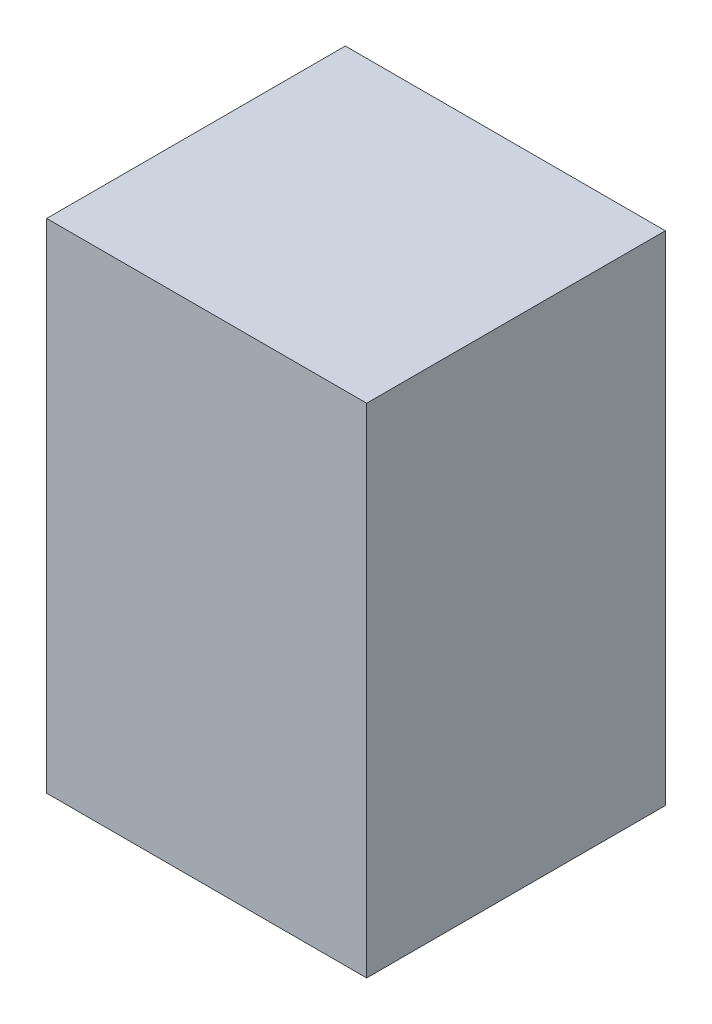
ISO-10303-21;
HEADER;
FILE_DESCRIPTION(('STEP AP214'),'2;1');
FILE_NAME('part.step','',(''),(''),'','','');
FILE_SCHEMA(('AUTOMOTIVE_DESIGN { 1 0 10303 214 1 1 1 1 }'));
ENDSEC;
DATA;
#1=APPLICATION_CONTEXT('core data for automotive mechanical design processes');
#2=APPLICATION_PROTOCOL_DEFINITION('international standard','automotive_design',2000,#1);
#3=PRODUCT_CONTEXT('',#1,'mechanical');
#4=PRODUCT('Part','Part','',(#3));
#5=PRODUCT_RELATED_PRODUCT_CATEGORY('part','',(#4));
#6=PRODUCT_DEFINITION_FORMATION('','',#4);
#7=PRODUCT_DEFINITION_CONTEXT('part definition',#1,'design');
#8=PRODUCT_DEFINITION('design','',#6,#7);
#9=PRODUCT_DEFINITION_SHAPE('','',#8);
#10=(LENGTH_UNIT() NAMED_UNIT(*) SI_UNIT(.MILLI.,.METRE.));
#11=(NAMED_UNIT(*) PLANE_ANGLE_UNIT() SI_UNIT($,.RADIAN.));
#12=(NAMED_UNIT(*) SI_UNIT($,.STERADIAN.) SOLID_ANGLE_UNIT());
#13=UNCERTAINTY_MEASURE_WITH_UNIT(LENGTH_MEASURE(1.E-05),#10,'distance_accuracy_value','');
#14=(GEOMETRIC_REPRESENTATION_CONTEXT(3) GLOBAL_UNCERTAINTY_ASSIGNED_CONTEXT((#13)) GLOBAL_UNIT_ASSIGNED_CONTEXT((#10,
#11,#12)) REPRESENTATION_CONTEXT('',''));
#15=CARTESIAN_POINT('',(0.,0.,0.));
#16=DIRECTION('',(0.,0.,1.));
#17=DIRECTION('',(1.,0.,0.));
#18=AXIS2_PLACEMENT_3D('',#15,#16,#17);
#19=CARTESIAN_POINT('',(-0.67499992,1.05000044,1.26));
#20=DIRECTION('',(0.,0.,1.));
#21=DIRECTION('',(1.,0.,0.));
#22=AXIS2_PLACEMENT_3D('',#19,#20,#21);
#23=PLANE('',#22);
#24=DIRECTION('',(0.,1.,0.));
#25=VECTOR('',#24,1.);
#26=CARTESIAN_POINT('',(0.67499992,1.05000044,1.26));
#27=LINE('',#26,#25);
#28=CARTESIAN_POINT('',(0.67499992,1.05000044,1.26));
#29=VERTEX_POINT('',#28);
#30=CARTESIAN_POINT('',(0.67499992,-1.05000044,1.26));
#31=VERTEX_POINT('',#30);
#32=EDGE_CURVE('E53',#29,#31,#27,.F.);
#33=ORIENTED_EDGE('',*,*,#32,.F.);
#34=DIRECTION('',(1.,0.,0.));
#35=VECTOR('',#34,1.);
#36=CARTESIAN_POINT('',(-0.67499992,1.05000044,1.26));
#37=LINE('',#36,#35);
#38=CARTESIAN_POINT('',(-0.67499992,1.05000044,1.26));
#39=VERTEX_POINT('',#38);
#40=EDGE_CURVE('E20',#29,#39,#37,.F.);
#41=ORIENTED_EDGE('',*,*,#40,.T.);
#42=DIRECTION('',(0.,1.,0.));
#43=VECTOR('',#42,1.);
#44=CARTESIAN_POINT('',(-0.67499992,-1.05000044,1.26));
#45=LINE('',#44,#43);
#46=CARTESIAN_POINT('',(-0.67499992,-1.05000044,1.26));
#47=VERTEX_POINT('',#46);
#48=EDGE_CURVE('E67',#47,#39,#45,.T.);
#49=ORIENTED_EDGE('',*,*,#48,.F.);
#50=DIRECTION('',(1.,0.,0.));
#51=VECTOR('',#50,1.);
#52=CARTESIAN_POINT('',(0.67499992,-1.05000044,1.26));
#53=LINE('',#52,#51);
#54=EDGE_CURVE('E58',#31,#47,#53,.F.);
#55=ORIENTED_EDGE('',*,*,#54,.F.);
#56=EDGE_LOOP('',(#33,#41,#49,#55));
#57=FACE_BOUND('',#56,.T.);
#58=ADVANCED_FACE('F17',(#57),#23,.T.);
#59=CARTESIAN_POINT('',(-0.67499992,-1.05000044,0.));
#60=DIRECTION('',(-1.,0.,0.));
#61=DIRECTION('',(0.,0.,1.));
#62=AXIS2_PLACEMENT_3D('',#59,#60,#61);
#63=PLANE('',#62);
#64=DIRECTION('',(0.,0.,1.));
#65=VECTOR('',#64,1.);
#66=CARTESIAN_POINT('',(-0.67499992,1.05000044,0.));
#67=LINE('',#66,#65);
#68=CARTESIAN_POINT('',(-0.67499992,1.05000044,0.));
#69=VERTEX_POINT('',#68);
#70=EDGE_CURVE('E80',#69,#39,#67,.T.);
#71=ORIENTED_EDGE('',*,*,#70,.F.);
#72=DIRECTION('',(0.,1.,0.));
#73=VECTOR('',#72,1.);
#74=CARTESIAN_POINT('',(-0.67499992,1.05000044,0.));
#75=LINE('',#74,#73);
#76=CARTESIAN_POINT('',(-0.67499992,-1.05000044,0.));
#77=VERTEX_POINT('',#76);
#78=EDGE_CURVE('E75',#69,#77,#75,.F.);
#79=ORIENTED_EDGE('',*,*,#78,.T.);
#80=DIRECTION('',(0.,0.,-1.));
#81=VECTOR('',#80,1.);
#82=CARTESIAN_POINT('',(-0.67499992,-1.05000044,0.));
#83=LINE('',#82,#81);
#84=EDGE_CURVE('E63',#47,#77,#83,.T.);
#85=ORIENTED_EDGE('',*,*,#84,.F.);
#86=ORIENTED_EDGE('',*,*,#48,.T.);
#87=EDGE_LOOP('',(#71,#79,#85,#86));
#88=FACE_BOUND('',#87,.T.);
#89=ADVANCED_FACE('F74',(#88),#63,.T.);
#90=CARTESIAN_POINT('',(0.67499992,-1.05000044,0.));
#91=DIRECTION('',(0.,-1.,0.));
#92=DIRECTION('',(0.,0.,-1.));
#93=AXIS2_PLACEMENT_3D('',#90,#91,#92);
#94=PLANE('',#93);
#95=ORIENTED_EDGE('',*,*,#84,.T.);
#96=DIRECTION('',(1.,0.,0.));
#97=VECTOR('',#96,1.);
#98=CARTESIAN_POINT('',(-0.67499992,-1.05000044,0.));
#99=LINE('',#98,#97);
#100=CARTESIAN_POINT('',(0.67499992,-1.05000044,0.));
#101=VERTEX_POINT('',#100);
#102=EDGE_CURVE('E84',#77,#101,#99,.T.);
#103=ORIENTED_EDGE('',*,*,#102,.T.);
#104=DIRECTION('',(0.,0.,-1.));
#105=VECTOR('',#104,1.);
#106=CARTESIAN_POINT('',(0.67499992,-1.05000044,0.));
#107=LINE('',#106,#105);
#108=EDGE_CURVE('E65',#31,#101,#107,.T.);
#109=ORIENTED_EDGE('',*,*,#108,.F.);
#110=ORIENTED_EDGE('',*,*,#54,.T.);
#111=EDGE_LOOP('',(#95,#103,#109,#110));
#112=FACE_BOUND('',#111,.T.);
#113=ADVANCED_FACE('F60',(#112),#94,.T.);
#114=CARTESIAN_POINT('',(0.67499992,1.05000044,0.));
#115=DIRECTION('',(1.,0.,0.));
#116=DIRECTION('',(0.,0.,-1.));
#117=AXIS2_PLACEMENT_3D('',#114,#115,#116);
#118=PLANE('',#117);
#119=ORIENTED_EDGE('',*,*,#108,.T.);
#120=DIRECTION('',(0.,1.,0.));
#121=VECTOR('',#120,1.);
#122=CARTESIAN_POINT('',(0.67499992,1.05000044,0.));
#123=LINE('',#122,#121);
#124=CARTESIAN_POINT('',(0.67499992,1.05000044,0.));
#125=VERTEX_POINT('',#124);
#126=EDGE_CURVE('E26',#101,#125,#123,.T.);
#127=ORIENTED_EDGE('',*,*,#126,.T.);
#128=DIRECTION('',(0.,0.,1.));
#129=VECTOR('',#128,1.);
#130=CARTESIAN_POINT('',(0.67499992,1.05000044,0.));
#131=LINE('',#130,#129);
#132=EDGE_CURVE('E34',#29,#125,#131,.F.);
#133=ORIENTED_EDGE('',*,*,#132,.F.);
#134=ORIENTED_EDGE('',*,*,#32,.T.);
#135=EDGE_LOOP('',(#119,#127,#133,#134));
#136=FACE_BOUND('',#135,.T.);
#137=ADVANCED_FACE('F88',(#136),#118,.T.);
#138=CARTESIAN_POINT('',(-0.67499992,1.05000044,0.));
#139=DIRECTION('',(0.,1.,0.));
#140=DIRECTION('',(0.,0.,1.));
#141=AXIS2_PLACEMENT_3D('',#138,#139,#140);
#142=PLANE('',#141);
#143=ORIENTED_EDGE('',*,*,#132,.T.);
#144=DIRECTION('',(1.,0.,0.));
#145=VECTOR('',#144,1.);
#146=CARTESIAN_POINT('',(-0.67499992,1.05000044,0.));
#147=LINE('',#146,#145);
#148=EDGE_CURVE('E11',#125,#69,#147,.F.);
#149=ORIENTED_EDGE('',*,*,#148,.T.);
#150=ORIENTED_EDGE('',*,*,#70,.T.);
#151=ORIENTED_EDGE('',*,*,#40,.F.);
#152=EDGE_LOOP('',(#143,#149,#150,#151));
#153=FACE_BOUND('',#152,.T.);
#154=ADVANCED_FACE('F91',(#153),#142,.T.);
#155=CARTESIAN_POINT('',(-0.67499992,1.05000044,0.));
#156=DIRECTION('',(0.,0.,1.));
#157=DIRECTION('',(1.,0.,0.));
#158=AXIS2_PLACEMENT_3D('',#155,#156,#157);
#159=PLANE('',#158);
#160=ORIENTED_EDGE('',*,*,#126,.F.);
#161=ORIENTED_EDGE('',*,*,#102,.F.);
#162=ORIENTED_EDGE('',*,*,#78,.F.);
#163=ORIENTED_EDGE('',*,*,#148,.F.);
#164=EDGE_LOOP('',(#160,#161,#162,#163));
#165=FACE_BOUND('',#164,.T.);
#166=ADVANCED_FACE('F90',(#165),#159,.F.);
#167=CLOSED_SHELL('',(#58,#89,#113,#137,#154,#166));
#168=MANIFOLD_SOLID_BREP('B1',#167);
#169=ADVANCED_BREP_SHAPE_REPRESENTATION('',(#18,#168),#14);
#170=SHAPE_DEFINITION_REPRESENTATION(#9,#169);
ENDSEC;
END-ISO-10303-21;
